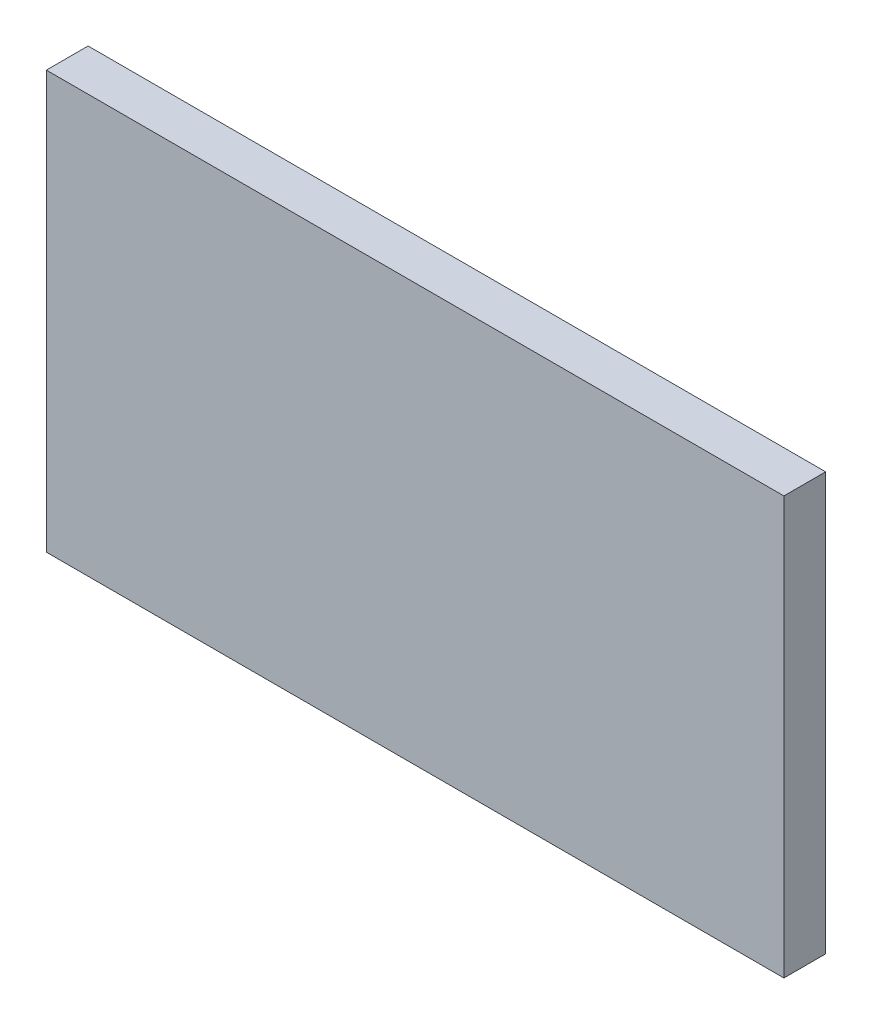
ISO-10303-21;
HEADER;
FILE_DESCRIPTION(('STEP AP214'),'2;1');
FILE_NAME('part.step','',(''),(''),'','','');
FILE_SCHEMA(('AUTOMOTIVE_DESIGN { 1 0 10303 214 1 1 1 1 }'));
ENDSEC;
DATA;
#1=APPLICATION_CONTEXT('core data for automotive mechanical design processes');
#2=APPLICATION_PROTOCOL_DEFINITION('international standard','automotive_design',2000,#1);
#3=PRODUCT_CONTEXT('',#1,'mechanical');
#4=PRODUCT('Part','Part','',(#3));
#5=PRODUCT_RELATED_PRODUCT_CATEGORY('part','',(#4));
#6=PRODUCT_DEFINITION_FORMATION('','',#4);
#7=PRODUCT_DEFINITION_CONTEXT('part definition',#1,'design');
#8=PRODUCT_DEFINITION('design','',#6,#7);
#9=PRODUCT_DEFINITION_SHAPE('','',#8);
#10=(LENGTH_UNIT() NAMED_UNIT(*) SI_UNIT(.MILLI.,.METRE.));
#11=(NAMED_UNIT(*) PLANE_ANGLE_UNIT() SI_UNIT($,.RADIAN.));
#12=(NAMED_UNIT(*) SI_UNIT($,.STERADIAN.) SOLID_ANGLE_UNIT());
#13=UNCERTAINTY_MEASURE_WITH_UNIT(LENGTH_MEASURE(1.E-05),#10,'distance_accuracy_value','');
#14=(GEOMETRIC_REPRESENTATION_CONTEXT(3) GLOBAL_UNCERTAINTY_ASSIGNED_CONTEXT((#13)) GLOBAL_UNIT_ASSIGNED_CONTEXT((#10,
#11,#12)) REPRESENTATION_CONTEXT('',''));
#15=CARTESIAN_POINT('',(0.,0.,0.));
#16=DIRECTION('',(0.,0.,1.));
#17=DIRECTION('',(1.,0.,0.));
#18=AXIS2_PLACEMENT_3D('',#15,#16,#17);
#19=CARTESIAN_POINT('',(-68.2172585860839,35.8199152542373,3.));
#20=DIRECTION('',(1.,0.,0.));
#21=DIRECTION('',(0.,0.,-1.));
#22=AXIS2_PLACEMENT_3D('',#19,#20,#21);
#23=PLANE('',#22);
#24=DIRECTION('',(0.,-1.,0.));
#25=VECTOR('',#24,1.);
#26=CARTESIAN_POINT('',(-68.2172585860839,35.8199152542373,0.));
#27=LINE('',#26,#25);
#28=CARTESIAN_POINT('',(-68.2172585860839,35.8199152542373,0.));
#29=VERTEX_POINT('',#28);
#30=CARTESIAN_POINT('',(-68.2172585860839,5.81991525423728,0.));
#31=VERTEX_POINT('',#30);
#32=EDGE_CURVE('E96',#29,#31,#27,.T.);
#33=ORIENTED_EDGE('',*,*,#32,.T.);
#34=DIRECTION('',(0.,0.,-1.));
#35=VECTOR('',#34,1.);
#36=CARTESIAN_POINT('',(-68.2172585860839,5.81991525423728,3.));
#37=LINE('',#36,#35);
#38=CARTESIAN_POINT('',(-68.2172585860839,5.81991525423728,3.));
#39=VERTEX_POINT('',#38);
#40=EDGE_CURVE('E11',#39,#31,#37,.T.);
#41=ORIENTED_EDGE('',*,*,#40,.F.);
#42=DIRECTION('',(0.,-1.,0.));
#43=VECTOR('',#42,1.);
#44=CARTESIAN_POINT('',(-68.2172585860839,35.8199152542373,3.));
#45=LINE('',#44,#43);
#46=CARTESIAN_POINT('',(-68.2172585860839,35.8199152542373,3.));
#47=VERTEX_POINT('',#46);
#48=EDGE_CURVE('E84',#47,#39,#45,.T.);
#49=ORIENTED_EDGE('',*,*,#48,.F.);
#50=DIRECTION('',(0.,0.,-1.));
#51=VECTOR('',#50,1.);
#52=CARTESIAN_POINT('',(-68.2172585860839,35.8199152542373,3.));
#53=LINE('',#52,#51);
#54=EDGE_CURVE('E92',#47,#29,#53,.T.);
#55=ORIENTED_EDGE('',*,*,#54,.T.);
#56=EDGE_LOOP('',(#33,#41,#49,#55));
#57=FACE_BOUND('',#56,.T.);
#58=ADVANCED_FACE('F33',(#57),#23,.F.);
#59=CARTESIAN_POINT('',(-68.2172585860839,5.81991525423728,3.));
#60=DIRECTION('',(0.,1.,0.));
#61=DIRECTION('',(0.,0.,1.));
#62=AXIS2_PLACEMENT_3D('',#59,#60,#61);
#63=PLANE('',#62);
#64=DIRECTION('',(1.,0.,0.));
#65=VECTOR('',#64,1.);
#66=CARTESIAN_POINT('',(-68.2172585860839,5.81991525423728,0.));
#67=LINE('',#66,#65);
#68=CARTESIAN_POINT('',(-15.2172585860838,5.81991525423728,0.));
#69=VERTEX_POINT('',#68);
#70=EDGE_CURVE('E88',#31,#69,#67,.T.);
#71=ORIENTED_EDGE('',*,*,#70,.T.);
#72=DIRECTION('',(0.,0.,-1.));
#73=VECTOR('',#72,1.);
#74=CARTESIAN_POINT('',(-15.2172585860838,5.81991525423728,3.));
#75=LINE('',#74,#73);
#76=CARTESIAN_POINT('',(-15.2172585860838,5.81991525423728,3.));
#77=VERTEX_POINT('',#76);
#78=EDGE_CURVE('E41',#77,#69,#75,.T.);
#79=ORIENTED_EDGE('',*,*,#78,.F.);
#80=DIRECTION('',(1.,0.,0.));
#81=VECTOR('',#80,1.);
#82=CARTESIAN_POINT('',(-68.2172585860839,5.81991525423728,3.));
#83=LINE('',#82,#81);
#84=EDGE_CURVE('E79',#39,#77,#83,.T.);
#85=ORIENTED_EDGE('',*,*,#84,.F.);
#86=ORIENTED_EDGE('',*,*,#40,.T.);
#87=EDGE_LOOP('',(#71,#79,#85,#86));
#88=FACE_BOUND('',#87,.T.);
#89=ADVANCED_FACE('F87',(#88),#63,.F.);
#90=CARTESIAN_POINT('',(-15.2172585860839,35.8199152542373,3.));
#91=DIRECTION('',(-1.,0.,0.));
#92=DIRECTION('',(0.,-1.,0.));
#93=AXIS2_PLACEMENT_3D('',#90,#91,#92);
#94=PLANE('',#93);
#95=DIRECTION('',(0.,1.,0.));
#96=VECTOR('',#95,1.);
#97=CARTESIAN_POINT('',(-15.2172585860839,35.8199152542373,0.));
#98=LINE('',#97,#96);
#99=CARTESIAN_POINT('',(-15.2172585860839,35.8199152542373,0.));
#100=VERTEX_POINT('',#99);
#101=EDGE_CURVE('E66',#69,#100,#98,.T.);
#102=ORIENTED_EDGE('',*,*,#101,.T.);
#103=DIRECTION('',(0.,0.,-1.));
#104=VECTOR('',#103,1.);
#105=CARTESIAN_POINT('',(-15.2172585860839,35.8199152542373,3.));
#106=LINE('',#105,#104);
#107=CARTESIAN_POINT('',(-15.2172585860839,35.8199152542373,3.));
#108=VERTEX_POINT('',#107);
#109=EDGE_CURVE('E89',#108,#100,#106,.T.);
#110=ORIENTED_EDGE('',*,*,#109,.F.);
#111=DIRECTION('',(0.,1.,0.));
#112=VECTOR('',#111,1.);
#113=CARTESIAN_POINT('',(-15.2172585860839,35.8199152542373,3.));
#114=LINE('',#113,#112);
#115=EDGE_CURVE('E82',#77,#108,#114,.T.);
#116=ORIENTED_EDGE('',*,*,#115,.F.);
#117=ORIENTED_EDGE('',*,*,#78,.T.);
#118=EDGE_LOOP('',(#102,#110,#116,#117));
#119=FACE_BOUND('',#118,.T.);
#120=ADVANCED_FACE('F90',(#119),#94,.F.);
#121=CARTESIAN_POINT('',(-68.2172585860839,35.8199152542373,3.));
#122=DIRECTION('',(0.,-1.,0.));
#123=DIRECTION('',(0.,0.,-1.));
#124=AXIS2_PLACEMENT_3D('',#121,#122,#123);
#125=PLANE('',#124);
#126=DIRECTION('',(-1.,0.,0.));
#127=VECTOR('',#126,1.);
#128=CARTESIAN_POINT('',(-68.2172585860839,35.8199152542373,0.));
#129=LINE('',#128,#127);
#130=EDGE_CURVE('E72',#100,#29,#129,.T.);
#131=ORIENTED_EDGE('',*,*,#130,.T.);
#132=ORIENTED_EDGE('',*,*,#54,.F.);
#133=DIRECTION('',(-1.,0.,0.));
#134=VECTOR('',#133,1.);
#135=CARTESIAN_POINT('',(-68.2172585860839,35.8199152542373,3.));
#136=LINE('',#135,#134);
#137=EDGE_CURVE('E49',#108,#47,#136,.T.);
#138=ORIENTED_EDGE('',*,*,#137,.F.);
#139=ORIENTED_EDGE('',*,*,#109,.T.);
#140=EDGE_LOOP('',(#131,#132,#138,#139));
#141=FACE_BOUND('',#140,.T.);
#142=ADVANCED_FACE('F103',(#141),#125,.F.);
#143=CARTESIAN_POINT('',(0.,0.,3.));
#144=DIRECTION('',(0.,0.,1.));
#145=DIRECTION('',(1.,0.,0.));
#146=AXIS2_PLACEMENT_3D('',#143,#144,#145);
#147=PLANE('',#146);
#148=ORIENTED_EDGE('',*,*,#48,.T.);
#149=ORIENTED_EDGE('',*,*,#84,.T.);
#150=ORIENTED_EDGE('',*,*,#115,.T.);
#151=ORIENTED_EDGE('',*,*,#137,.T.);
#152=EDGE_LOOP('',(#148,#149,#150,#151));
#153=FACE_BOUND('',#152,.T.);
#154=ADVANCED_FACE('F80',(#153),#147,.T.);
#155=CARTESIAN_POINT('',(0.,0.,0.));
#156=DIRECTION('',(0.,0.,1.));
#157=DIRECTION('',(1.,0.,0.));
#158=AXIS2_PLACEMENT_3D('',#155,#156,#157);
#159=PLANE('',#158);
#160=ORIENTED_EDGE('',*,*,#32,.F.);
#161=ORIENTED_EDGE('',*,*,#130,.F.);
#162=ORIENTED_EDGE('',*,*,#101,.F.);
#163=ORIENTED_EDGE('',*,*,#70,.F.);
#164=EDGE_LOOP('',(#160,#161,#162,#163));
#165=FACE_BOUND('',#164,.T.);
#166=ADVANCED_FACE('F106',(#165),#159,.F.);
#167=CLOSED_SHELL('',(#58,#89,#120,#142,#154,#166));
#168=MANIFOLD_SOLID_BREP('B2',#167);
#169=ADVANCED_BREP_SHAPE_REPRESENTATION('',(#18,#168),#14);
#170=SHAPE_DEFINITION_REPRESENTATION(#9,#169);
ENDSEC;
END-ISO-10303-21;
